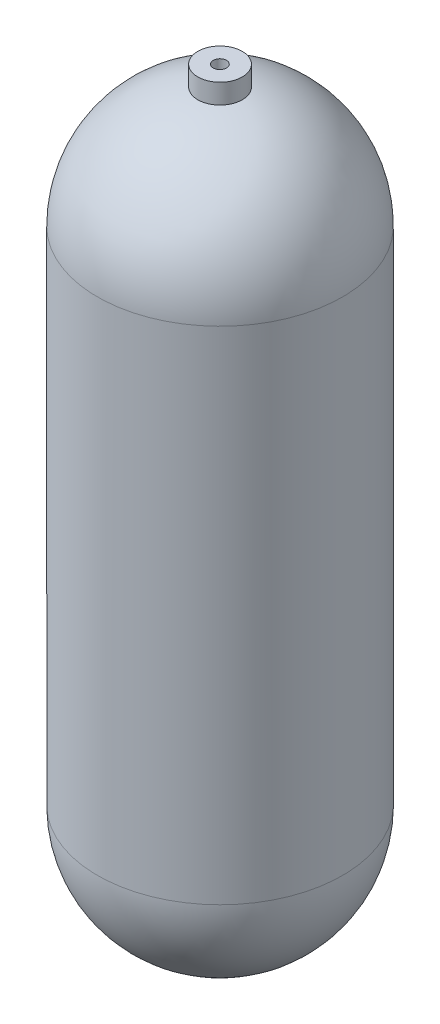
ISO-10303-21;
HEADER;
FILE_DESCRIPTION(('STEP AP214'),'2;1');
FILE_NAME('part.step','',(''),(''),'','','');
FILE_SCHEMA(('AUTOMOTIVE_DESIGN { 1 0 10303 214 1 1 1 1 }'));
ENDSEC;
DATA;
#1=APPLICATION_CONTEXT('core data for automotive mechanical design processes');
#2=APPLICATION_PROTOCOL_DEFINITION('international standard','automotive_design',2000,#1);
#3=PRODUCT_CONTEXT('',#1,'mechanical');
#4=PRODUCT('Part','Part','',(#3));
#5=PRODUCT_RELATED_PRODUCT_CATEGORY('part','',(#4));
#6=PRODUCT_DEFINITION_FORMATION('','',#4);
#7=PRODUCT_DEFINITION_CONTEXT('part definition',#1,'design');
#8=PRODUCT_DEFINITION('design','',#6,#7);
#9=PRODUCT_DEFINITION_SHAPE('','',#8);
#10=(LENGTH_UNIT() NAMED_UNIT(*) SI_UNIT(.MILLI.,.METRE.));
#11=(NAMED_UNIT(*) PLANE_ANGLE_UNIT() SI_UNIT($,.RADIAN.));
#12=(NAMED_UNIT(*) SI_UNIT($,.STERADIAN.) SOLID_ANGLE_UNIT());
#13=UNCERTAINTY_MEASURE_WITH_UNIT(LENGTH_MEASURE(1.E-05),#10,'distance_accuracy_value','');
#14=(GEOMETRIC_REPRESENTATION_CONTEXT(3) GLOBAL_UNCERTAINTY_ASSIGNED_CONTEXT((#13)) GLOBAL_UNIT_ASSIGNED_CONTEXT((#10,
#11,#12)) REPRESENTATION_CONTEXT('',''));
#15=CARTESIAN_POINT('',(0.,0.,0.));
#16=DIRECTION('',(0.,0.,1.));
#17=DIRECTION('',(1.,0.,0.));
#18=AXIS2_PLACEMENT_3D('',#15,#16,#17);
#19=CARTESIAN_POINT('',(0.,445.77,0.));
#20=DIRECTION('',(0.,-1.,0.));
#21=DIRECTION('',(1.,0.,0.));
#22=AXIS2_PLACEMENT_3D('',#19,#20,#21);
#23=SPHERICAL_SURFACE('',#22,84.455);
#24=CARTESIAN_POINT('',(-3.42177597816269,530.092160464417,-3.27287775028901));
#25=CARTESIAN_POINT('',(-3.32718936516888,530.092325436191,-3.36751861949206));
#26=CARTESIAN_POINT('',(-3.22862246946506,530.092488471703,-3.45815915703799));
#27=CARTESIAN_POINT('',(-3.02417570259944,530.092809605651,-3.6308500417602));
#28=CARTESIAN_POINT('',(-2.91829391413507,530.092967702776,-3.71289812248595));
#29=CARTESIAN_POINT('',(-2.69990181161929,530.09327791709,-3.86785481691451));
#30=CARTESIAN_POINT('',(-2.58738567032622,530.093430028819,-3.94075521459818));
#31=CARTESIAN_POINT('',(-2.35656713108971,530.093727098809,-4.07683940415347));
#32=CARTESIAN_POINT('',(-2.23826263193611,530.093872054433,-4.14001963252989));
#33=CARTESIAN_POINT('',(-1.99685048673871,530.094153600404,-4.25613184358929));
#34=CARTESIAN_POINT('',(-1.87374698386647,530.094290197717,-4.30907244100888));
#35=CARTESIAN_POINT('',(-1.62347167671575,530.094554238316,-4.40441320110816));
#36=CARTESIAN_POINT('',(-1.49629838923857,530.094681678207,-4.44680947046421));
#37=CARTESIAN_POINT('',(-1.23891111844678,530.094926366148,-4.52071167279915));
#38=CARTESIAN_POINT('',(-1.10869906150626,530.095043620442,-4.55222431525039));
#39=CARTESIAN_POINT('',(-0.846035082805294,530.095267233823,-4.6041812671521));
#40=CARTESIAN_POINT('',(-0.713582352129027,530.095373588872,-4.62462148739579));
#41=CARTESIAN_POINT('',(-0.447461042490856,530.095574571503,-4.65426653021286));
#42=CARTESIAN_POINT('',(-0.313792794742697,530.095669202183,-4.6634743262215));
#43=CARTESIAN_POINT('',(-0.046106233995461,530.095846129559,-4.67060029319859));
#44=CARTESIAN_POINT('',(0.0879121900407832,530.095928421688,-4.66851429418855));
#45=CARTESIAN_POINT('',(0.355252600901077,530.09608001935,-4.65306035475248));
#46=CARTESIAN_POINT('',(0.488574802824416,530.096149329157,-4.63969613517466));
#47=CARTESIAN_POINT('',(0.753668677074541,530.096274527069,-4.60177877750266));
#48=CARTESIAN_POINT('',(0.885439758739989,530.096330410208,-4.57722151005877));
#49=CARTESIAN_POINT('',(1.14639387563792,530.096428304686,-4.51710254077093));
#50=CARTESIAN_POINT('',(1.27557789640634,530.096470321404,-4.48154511771614));
#51=CARTESIAN_POINT('',(1.53053723003702,530.096540228499,-4.39966259060251));
#52=CARTESIAN_POINT('',(1.65631126681255,530.096568113655,-4.35333351601514));
#53=CARTESIAN_POINT('',(1.90346971614049,530.096609524066,-4.25025481433802));
#54=CARTESIAN_POINT('',(2.0248557402722,530.096623054646,-4.19350906047832));
#55=CARTESIAN_POINT('',(2.26243416184144,530.09663569521,-4.06999857096363));
#56=CARTESIAN_POINT('',(2.37862462523366,530.096634799868,-4.00323014401213));
#57=CARTESIAN_POINT('',(2.71804440711929,530.096610409416,-3.78860312191545));
#58=CARTESIAN_POINT('',(2.93239031332985,530.096565254495,-3.62631064812813));
#59=CARTESIAN_POINT('',(3.33067153822858,530.096418380523,-3.26812677357915));
#60=CARTESIAN_POINT('',(3.51460691172997,530.096316661573,-3.07223543337881));
#61=CARTESIAN_POINT('',(3.8470122417622,530.096059558989,-2.65233080318308));
#62=CARTESIAN_POINT('',(3.99548218307477,530.095904175333,-2.42831750112058));
#63=CARTESIAN_POINT('',(4.25269759971844,530.095544149369,-1.95855021505679));
#64=CARTESIAN_POINT('',(4.36144303302198,530.095339507011,-1.71279620805471));
#65=CARTESIAN_POINT('',(4.53613420438209,530.094886773373,-1.20651790313526));
#66=CARTESIAN_POINT('',(4.60207993322635,530.094638682084,-0.945993602038718));
#67=CARTESIAN_POINT('',(4.68929646231125,530.094106091389,-0.417571987651945));
#68=CARTESIAN_POINT('',(4.71056728044916,530.093821591998,-0.149674677315474));
#69=CARTESIAN_POINT('',(4.70783109877361,530.093224260558,0.385888935914079));
#70=CARTESIAN_POINT('',(4.68382405705382,530.092911428482,0.653555238593124));
#71=CARTESIAN_POINT('',(4.59121334003302,530.092266310777,1.18105825893464));
#72=CARTESIAN_POINT('',(4.52260965871765,530.091934025145,1.4408949755412));
#73=CARTESIAN_POINT('',(4.34275312232009,530.091259432868,1.94536299509209));
#74=CARTESIAN_POINT('',(4.23150023960219,530.090917126218,2.18999428818354));
#75=CARTESIAN_POINT('',(3.96950343606684,530.09023220837,2.65710690014135));
#76=CARTESIAN_POINT('',(3.81875951693568,530.089889597172,2.87958821995353));
#77=CARTESIAN_POINT('',(3.482059765733,530.089213796642,3.29608537345295));
#78=CARTESIAN_POINT('',(3.29610392343766,530.088880607312,3.49010119887517));
#79=CARTESIAN_POINT('',(2.89425907528034,530.088233108743,3.84415974352631));
#80=CARTESIAN_POINT('',(2.67837006808483,530.087918799503,4.00420246124171));
#81=CARTESIAN_POINT('',(2.22278740353394,530.087317984934,4.28577160959091));
#82=CARTESIAN_POINT('',(1.98309375081026,530.087031479599,4.40729804771884));
#83=CARTESIAN_POINT('',(1.48670594751079,530.086494406234,4.60838481463206));
#84=CARTESIAN_POINT('',(1.23001179921006,530.086243838201,4.68794514903337));
#85=CARTESIAN_POINT('',(0.706910145474448,530.085785754074,4.8028413816184));
#86=CARTESIAN_POINT('',(0.440502647792808,530.085578237945,4.83817731510141));
#87=CARTESIAN_POINT('',(-0.0944640770341817,530.085212148928,4.86362101897593));
#88=CARTESIAN_POINT('',(-0.363023305041008,530.085053576058,4.85372877125878));
#89=CARTESIAN_POINT('',(-0.894667393087526,530.084789875,4.78899966935525));
#90=CARTESIAN_POINT('',(-1.15775225569857,530.084684746788,4.73416283628015));
#91=CARTESIAN_POINT('',(-1.67098760693319,530.08453092558,4.58109092406599));
#92=CARTESIAN_POINT('',(-1.92113810925875,530.084482232526,4.48285589090171));
#93=CARTESIAN_POINT('',(-2.40137257013465,530.084442641178,4.24581510559861));
#94=CARTESIAN_POINT('',(-2.63145654782396,530.08445174283,4.10700939215565));
#95=CARTESIAN_POINT('',(-3.06514365495298,530.084527569365,3.79262239478704));
#96=CARTESIAN_POINT('',(-3.2687467367125,530.084594294353,3.61704104464649));
#97=CARTESIAN_POINT('',(-3.54973010415093,530.084735984361,3.33012843928748));
#98=CARTESIAN_POINT('',(-3.63936245676613,530.084790188302,3.23050781934983));
#99=CARTESIAN_POINT('',(-3.80991244893412,530.084912087942,3.02408358457359));
#100=CARTESIAN_POINT('',(-3.89083329258034,530.084979778656,2.91728263430174));
#101=CARTESIAN_POINT('',(-4.04341245190644,530.085128205317,2.69720985254797));
#102=CARTESIAN_POINT('',(-4.1150673180524,530.085208946097,2.58393563369946));
#103=CARTESIAN_POINT('',(-4.24855543520084,530.085382850207,2.35179378315561));
#104=CARTESIAN_POINT('',(-4.31039230118963,530.085476008941,2.23292823118261));
#105=CARTESIAN_POINT('',(-4.42385612762898,530.085674147662,1.9903644709907));
#106=CARTESIAN_POINT('',(-4.47547911446778,530.085779132225,1.86666440427434));
#107=CARTESIAN_POINT('',(-4.56810164335264,530.086000105976,1.61540079333074));
#108=CARTESIAN_POINT('',(-4.60910509929675,530.086116091087,1.48783869189709));
#109=CARTESIAN_POINT('',(-4.68023366023864,530.086358313618,1.22967151424544));
#110=CARTESIAN_POINT('',(-4.71035517208624,530.086484554406,1.09906544805497));
#111=CARTESIAN_POINT('',(-4.75947766426544,530.086746309255,0.835828486949495));
#112=CARTESIAN_POINT('',(-4.77848274524785,530.086881819875,0.703198357223632));
#113=CARTESIAN_POINT('',(-4.805258143676,530.087161229599,0.436773292956808));
#114=CARTESIAN_POINT('',(-4.81302548203378,530.087305130916,0.302978059003863));
#115=CARTESIAN_POINT('',(-4.81725988468873,530.087600211598,0.0352583690925719));
#116=CARTESIAN_POINT('',(-4.81373111689343,530.087751388258,-0.0986660209820354));
#117=CARTESIAN_POINT('',(-4.79540181197411,530.088060090002,-0.365824500308));
#118=CARTESIAN_POINT('',(-4.78059431066611,530.088217618952,-0.499058111836542));
#119=CARTESIAN_POINT('',(-4.73981218602948,530.088537757624,-0.763754702064733));
#120=CARTESIAN_POINT('',(-4.7138416803621,530.088700365452,-0.895218315235176));
#121=CARTESIAN_POINT('',(-4.65089206413755,530.089029701005,-1.15560101855225));
#122=CARTESIAN_POINT('',(-4.61390365327107,530.0891964321,-1.28451786052427));
#123=CARTESIAN_POINT('',(-4.52920563950025,530.089532631619,-1.53872712322586));
#124=CARTESIAN_POINT('',(-4.48149996126001,530.08970209902,-1.66402085182956));
#125=CARTESIAN_POINT('',(-4.37574459096999,530.090042476613,-1.91003404764385));
#126=CARTESIAN_POINT('',(-4.31770415357397,530.090213385384,-2.03075749116352));
#127=CARTESIAN_POINT('',(-4.19168620217327,530.090555522138,-2.26685091975502));
#128=CARTESIAN_POINT('',(-4.12371130605659,530.090726750025,-2.3822223046602));
#129=CARTESIAN_POINT('',(-3.96017342870327,530.091110916689,-2.63480870999076));
#130=CARTESIAN_POINT('',(-3.861954631249,530.091323631405,-2.77031474607268));
#131=CARTESIAN_POINT('',(-3.65181849019435,530.091745392179,-3.03025280288365));
#132=CARTESIAN_POINT('',(-3.53990114658839,530.091954438238,-3.15468482360819));
#133=CARTESIAN_POINT('',(-3.42177597816269,530.092160464417,-3.27287775028901));
#134=B_SPLINE_CURVE_WITH_KNOTS('',3,(#24,#25,#26,#27,#28,#29,#30,#31,#32,#33,#34,#35,#36,#37,
#38,#39,#40,#41,#42,#43,#44,#45,#46,#47,#48,#49,#50,#51,#52,#53,#54,#55,#56,#57,#58,#59,#60,#61,
#62,#63,#64,#65,#66,#67,#68,#69,#70,#71,#72,#73,#74,#75,#76,#77,#78,#79,#80,#81,#82,#83,#84,#85,
#86,#87,#88,#89,#90,#91,#92,#93,#94,#95,#96,#97,#98,#99,#100,#101,#102,#103,#104,#105,#106,#107,
#108,#109,#110,#111,#112,#113,#114,#115,#116,#117,#118,#119,#120,#121,#122,#123,#124,#125,#126,
#127,#128,#129,#130,#131,#132,#133),.UNSPECIFIED.,.T.,.F.,(4,2,2,2,2,2,2,2,2,2,2,2,2,2,2,2,2,2,
2,2,2,2,2,2,2,2,2,2,2,2,2,2,2,2,2,2,2,2,2,2,2,2,2,2,2,2,2,2,2,2,2,2,2,2,4),(0.,
0.401266468792226,0.802638515305708,1.20436851358087,1.60624544026586,2.00778277772821,
2.40946815702058,2.8109054638805,3.21249092648186,3.61397005872682,4.01559743817245,
4.41709236670899,4.81873553516984,5.22022267036379,5.6218580326451,6.02334435638779,
6.42497890982162,7.22738692281227,8.02979348949326,8.83220040048752,9.63460816040635,
10.4370160930374,11.2394237042147,12.0418320580502,12.8442405200995,13.6466495020916,
14.4490584498202,15.2514676305298,16.0538768469874,16.8562859073198,17.6586948602716,
18.4611031727512,19.2635118065026,20.0659200633484,20.8683274701482,21.6707341116232,
22.4731421978516,22.874776560448,23.2762626935527,23.6778978640596,24.0793848078801,
24.4810276405433,24.8825222337646,25.2841492770929,25.685628073864,26.0872132818315,
26.488650334582,26.8903354604053,27.2918725449191,27.6937495355101,28.0954795979179,
28.4968517086383,28.8981182414901,29.3992427419883,29.9003672426908),.UNSPECIFIED.);
#135=CARTESIAN_POINT('',(-3.42177597816269,530.092160464417,-3.27287775028901));
#136=VERTEX_POINT('',#135);
#137=EDGE_CURVE('E39',#136,#136,#134,.T.);
#138=ORIENTED_EDGE('',*,*,#137,.F.);
#139=EDGE_LOOP('',(#138));
#140=FACE_BOUND('',#139,.T.);
#141=CARTESIAN_POINT('',(0.,445.77,0.));
#142=DIRECTION('',(0.,-1.,0.));
#143=DIRECTION('',(0.,0.,-1.));
#144=AXIS2_PLACEMENT_3D('',#141,#142,#143);
#145=CIRCLE('',#144,84.455);
#146=CARTESIAN_POINT('',(0.,445.77,-84.455));
#147=VERTEX_POINT('',#146);
#148=EDGE_CURVE('E47',#147,#147,#145,.T.);
#149=ORIENTED_EDGE('',*,*,#148,.T.);
#150=EDGE_LOOP('',(#149));
#151=FACE_BOUND('',#150,.T.);
#152=ADVANCED_FACE('F35',(#140,#151),#23,.F.);
#153=CARTESIAN_POINT('',(0.,533.4,0.));
#154=DIRECTION('',(0.,-1.,0.));
#155=DIRECTION('',(0.,0.,-1.));
#156=AXIS2_PLACEMENT_3D('',#153,#154,#155);
#157=CYLINDRICAL_SURFACE('',#156,84.455);
#158=CARTESIAN_POINT('',(0.,87.63,0.));
#159=DIRECTION('',(0.,-1.,0.));
#160=DIRECTION('',(0.,0.,-1.));
#161=AXIS2_PLACEMENT_3D('',#158,#159,#160);
#162=CIRCLE('',#161,84.455);
#163=CARTESIAN_POINT('',(0.,87.63,-84.455));
#164=VERTEX_POINT('',#163);
#165=EDGE_CURVE('E54',#164,#164,#162,.T.);
#166=ORIENTED_EDGE('',*,*,#165,.T.);
#167=EDGE_LOOP('',(#166));
#168=FACE_BOUND('',#167,.T.);
#169=ORIENTED_EDGE('',*,*,#148,.F.);
#170=EDGE_LOOP('',(#169));
#171=FACE_BOUND('',#170,.T.);
#172=ADVANCED_FACE('F81',(#168,#171),#157,.F.);
#173=CARTESIAN_POINT('',(0.,87.63,0.));
#174=DIRECTION('',(0.,-1.,0.));
#175=DIRECTION('',(1.,0.,0.));
#176=AXIS2_PLACEMENT_3D('',#173,#174,#175);
#177=SPHERICAL_SURFACE('',#176,84.455);
#178=ORIENTED_EDGE('',*,*,#165,.F.);
#179=EDGE_LOOP('',(#178));
#180=FACE_BOUND('',#179,.T.);
#181=ADVANCED_FACE('F85',(#180),#177,.F.);
#182=CARTESIAN_POINT('',(-0.0532386612324132,546.1,0.0937767604156647));
#183=DIRECTION('',(0.,1.,0.));
#184=DIRECTION('',(0.,0.,1.));
#185=AXIS2_PLACEMENT_3D('',#182,#183,#184);
#186=CYLINDRICAL_SURFACE('',#185,4.76249999999999);
#187=ORIENTED_EDGE('',*,*,#137,.T.);
#188=EDGE_LOOP('',(#187));
#189=FACE_BOUND('',#188,.T.);
#190=CARTESIAN_POINT('',(-0.0532386612324132,546.1,0.0937767604156647));
#191=DIRECTION('',(0.,1.,0.));
#192=DIRECTION('',(0.,0.,1.));
#193=AXIS2_PLACEMENT_3D('',#190,#191,#192);
#194=CIRCLE('',#193,4.7625);
#195=CARTESIAN_POINT('',(-0.0532386612324132,546.1,4.85627676041566));
#196=VERTEX_POINT('',#195);
#197=EDGE_CURVE('E70',#196,#196,#194,.T.);
#198=ORIENTED_EDGE('',*,*,#197,.T.);
#199=EDGE_LOOP('',(#198));
#200=FACE_BOUND('',#199,.T.);
#201=ADVANCED_FACE('F77',(#189,#200),#186,.F.);
#202=CARTESIAN_POINT('',(0.,445.77,0.));
#203=DIRECTION('',(0.,-1.,0.));
#204=DIRECTION('',(1.,0.,0.));
#205=AXIS2_PLACEMENT_3D('',#202,#203,#204);
#206=SPHERICAL_SURFACE('',#205,87.63);
#207=CARTESIAN_POINT('',(0.,531.950051490918,0.));
#208=DIRECTION('',(0.,-1.,0.));
#209=DIRECTION('',(0.,0.,-1.));
#210=AXIS2_PLACEMENT_3D('',#207,#208,#209);
#211=CIRCLE('',#210,15.875);
#212=CARTESIAN_POINT('',(0.,531.950051490918,-15.875));
#213=VERTEX_POINT('',#212);
#214=EDGE_CURVE('E10',#213,#213,#211,.F.);
#215=ORIENTED_EDGE('',*,*,#214,.F.);
#216=EDGE_LOOP('',(#215));
#217=FACE_BOUND('',#216,.T.);
#218=CARTESIAN_POINT('',(0.,445.77,0.));
#219=DIRECTION('',(0.,-1.,0.));
#220=DIRECTION('',(0.,0.,-1.));
#221=AXIS2_PLACEMENT_3D('',#218,#219,#220);
#222=CIRCLE('',#221,87.63);
#223=CARTESIAN_POINT('',(0.,445.77,-87.63));
#224=VERTEX_POINT('',#223);
#225=EDGE_CURVE('E62',#224,#224,#222,.T.);
#226=ORIENTED_EDGE('',*,*,#225,.F.);
#227=EDGE_LOOP('',(#226));
#228=FACE_BOUND('',#227,.T.);
#229=ADVANCED_FACE('F37',(#217,#228),#206,.T.);
#230=CARTESIAN_POINT('',(0.,87.63,0.));
#231=DIRECTION('',(0.,-1.,0.));
#232=DIRECTION('',(-1.,0.,0.));
#233=AXIS2_PLACEMENT_3D('',#230,#231,#232);
#234=SPHERICAL_SURFACE('',#233,87.63);
#235=CARTESIAN_POINT('',(0.,87.63,0.));
#236=DIRECTION('',(0.,-1.,0.));
#237=DIRECTION('',(0.,0.,-1.));
#238=AXIS2_PLACEMENT_3D('',#235,#236,#237);
#239=CIRCLE('',#238,87.63);
#240=CARTESIAN_POINT('',(0.,87.63,-87.63));
#241=VERTEX_POINT('',#240);
#242=EDGE_CURVE('E59',#241,#241,#239,.T.);
#243=ORIENTED_EDGE('',*,*,#242,.T.);
#244=EDGE_LOOP('',(#243));
#245=FACE_BOUND('',#244,.T.);
#246=ADVANCED_FACE('F95',(#245),#234,.T.);
#247=CARTESIAN_POINT('',(0.,533.4,0.));
#248=DIRECTION('',(0.,-1.,0.));
#249=DIRECTION('',(0.,0.,-1.));
#250=AXIS2_PLACEMENT_3D('',#247,#248,#249);
#251=CYLINDRICAL_SURFACE('',#250,87.63);
#252=ORIENTED_EDGE('',*,*,#225,.T.);
#253=EDGE_LOOP('',(#252));
#254=FACE_BOUND('',#253,.T.);
#255=ORIENTED_EDGE('',*,*,#242,.F.);
#256=EDGE_LOOP('',(#255));
#257=FACE_BOUND('',#256,.T.);
#258=ADVANCED_FACE('F98',(#254,#257),#251,.T.);
#259=CARTESIAN_POINT('',(0.,-500000.,0.));
#260=DIRECTION('',(0.,1.,0.));
#261=DIRECTION('',(0.,0.,1.));
#262=AXIS2_PLACEMENT_3D('',#259,#260,#261);
#263=CYLINDRICAL_SURFACE('',#262,15.875);
#264=ORIENTED_EDGE('',*,*,#214,.T.);
#265=EDGE_LOOP('',(#264));
#266=FACE_BOUND('',#265,.T.);
#267=CARTESIAN_POINT('',(0.,546.1,0.));
#268=DIRECTION('',(0.,1.,0.));
#269=DIRECTION('',(0.,0.,1.));
#270=AXIS2_PLACEMENT_3D('',#267,#268,#269);
#271=CIRCLE('',#270,15.875);
#272=CARTESIAN_POINT('',(0.,546.1,15.875));
#273=VERTEX_POINT('',#272);
#274=EDGE_CURVE('E66',#273,#273,#271,.T.);
#275=ORIENTED_EDGE('',*,*,#274,.F.);
#276=EDGE_LOOP('',(#275));
#277=FACE_BOUND('',#276,.T.);
#278=ADVANCED_FACE('F102',(#266,#277),#263,.T.);
#279=CARTESIAN_POINT('',(0.,546.1,0.));
#280=DIRECTION('',(0.,1.,0.));
#281=DIRECTION('',(0.,0.,1.));
#282=AXIS2_PLACEMENT_3D('',#279,#280,#281);
#283=PLANE('',#282);
#284=ORIENTED_EDGE('',*,*,#197,.F.);
#285=EDGE_LOOP('',(#284));
#286=FACE_BOUND('',#285,.T.);
#287=ORIENTED_EDGE('',*,*,#274,.T.);
#288=EDGE_LOOP('',(#287));
#289=FACE_BOUND('',#288,.T.);
#290=ADVANCED_FACE('F106',(#286,#289),#283,.T.);
#291=CLOSED_SHELL('',(#152,#172,#181,#201,#229,#246,#258,#278,#290));
#292=MANIFOLD_SOLID_BREP('B2',#291);
#293=ADVANCED_BREP_SHAPE_REPRESENTATION('',(#18,#292),#14);
#294=SHAPE_DEFINITION_REPRESENTATION(#9,#293);
ENDSEC;
END-ISO-10303-21;
